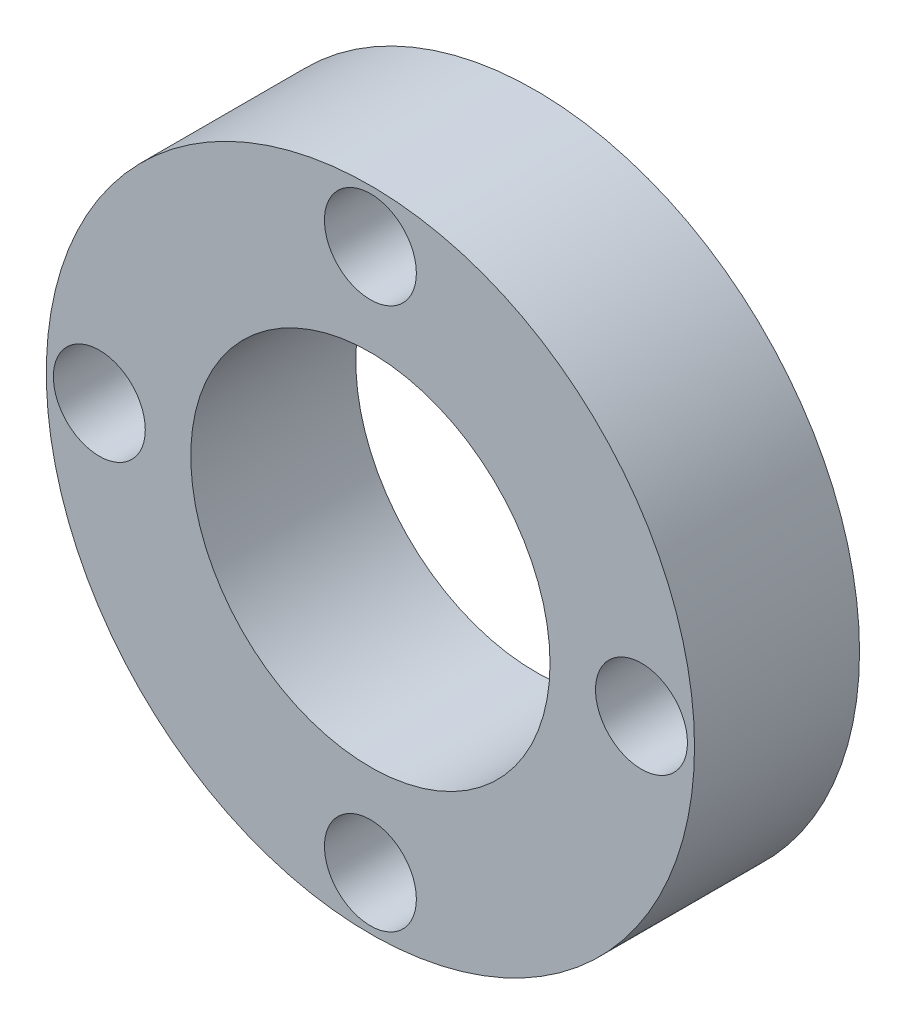
ISO-10303-21;
HEADER;
FILE_DESCRIPTION(('STEP AP214'),'2;1');
FILE_NAME('part.step','',(''),(''),'','','');
FILE_SCHEMA(('AUTOMOTIVE_DESIGN { 1 0 10303 214 1 1 1 1 }'));
ENDSEC;
DATA;
#1=APPLICATION_CONTEXT('core data for automotive mechanical design processes');
#2=APPLICATION_PROTOCOL_DEFINITION('international standard','automotive_design',2000,#1);
#3=PRODUCT_CONTEXT('',#1,'mechanical');
#4=PRODUCT('Part','Part','',(#3));
#5=PRODUCT_RELATED_PRODUCT_CATEGORY('part','',(#4));
#6=PRODUCT_DEFINITION_FORMATION('','',#4);
#7=PRODUCT_DEFINITION_CONTEXT('part definition',#1,'design');
#8=PRODUCT_DEFINITION('design','',#6,#7);
#9=PRODUCT_DEFINITION_SHAPE('','',#8);
#10=(LENGTH_UNIT() NAMED_UNIT(*) SI_UNIT(.MILLI.,.METRE.));
#11=(NAMED_UNIT(*) PLANE_ANGLE_UNIT() SI_UNIT($,.RADIAN.));
#12=(NAMED_UNIT(*) SI_UNIT($,.STERADIAN.) SOLID_ANGLE_UNIT());
#13=UNCERTAINTY_MEASURE_WITH_UNIT(LENGTH_MEASURE(1.E-05),#10,'distance_accuracy_value','');
#14=(GEOMETRIC_REPRESENTATION_CONTEXT(3) GLOBAL_UNCERTAINTY_ASSIGNED_CONTEXT((#13)) GLOBAL_UNIT_ASSIGNED_CONTEXT((#10,
#11,#12)) REPRESENTATION_CONTEXT('',''));
#15=CARTESIAN_POINT('',(0.,0.,0.));
#16=DIRECTION('',(0.,0.,1.));
#17=DIRECTION('',(1.,0.,0.));
#18=AXIS2_PLACEMENT_3D('',#15,#16,#17);
#19=CARTESIAN_POINT('',(0.,0.,-7.));
#20=DIRECTION('',(0.,0.,1.));
#21=DIRECTION('',(1.,0.,0.));
#22=AXIS2_PLACEMENT_3D('',#19,#20,#21);
#23=CYLINDRICAL_SURFACE('',#22,13.75);
#24=CARTESIAN_POINT('',(0.,0.,-7.));
#25=DIRECTION('',(0.,0.,1.));
#26=DIRECTION('',(1.,0.,0.));
#27=AXIS2_PLACEMENT_3D('',#24,#25,#26);
#28=CIRCLE('',#27,13.75);
#29=CARTESIAN_POINT('',(13.75,0.,-7.));
#30=VERTEX_POINT('',#29);
#31=EDGE_CURVE('E10',#30,#30,#28,.T.);
#32=ORIENTED_EDGE('',*,*,#31,.T.);
#33=EDGE_LOOP('',(#32));
#34=FACE_BOUND('',#33,.T.);
#35=CARTESIAN_POINT('',(0.,0.,0.));
#36=DIRECTION('',(0.,0.,1.));
#37=DIRECTION('',(1.,0.,0.));
#38=AXIS2_PLACEMENT_3D('',#35,#36,#37);
#39=CIRCLE('',#38,13.75);
#40=CARTESIAN_POINT('',(13.75,0.,0.));
#41=VERTEX_POINT('',#40);
#42=EDGE_CURVE('E34',#41,#41,#39,.T.);
#43=ORIENTED_EDGE('',*,*,#42,.F.);
#44=EDGE_LOOP('',(#43));
#45=FACE_BOUND('',#44,.T.);
#46=ADVANCED_FACE('F31',(#34,#45),#23,.T.);
#47=CARTESIAN_POINT('',(0.,0.,-7.));
#48=DIRECTION('',(0.,0.,1.));
#49=DIRECTION('',(1.,0.,0.));
#50=AXIS2_PLACEMENT_3D('',#47,#48,#49);
#51=PLANE('',#50);
#52=CARTESIAN_POINT('',(-11.49999986,0.,-7.));
#53=DIRECTION('',(0.,0.,1.));
#54=DIRECTION('',(1.,0.,0.));
#55=AXIS2_PLACEMENT_3D('',#52,#53,#54);
#56=CIRCLE('',#55,1.9499961);
#57=CARTESIAN_POINT('',(-9.55000376,0.,-7.));
#58=VERTEX_POINT('',#57);
#59=EDGE_CURVE('E46',#58,#58,#56,.F.);
#60=ORIENTED_EDGE('',*,*,#59,.F.);
#61=EDGE_LOOP('',(#60));
#62=FACE_BOUND('',#61,.T.);
#63=CARTESIAN_POINT('',(0.,11.49999986,-7.));
#64=DIRECTION('',(0.,0.,1.));
#65=DIRECTION('',(1.,0.,0.));
#66=AXIS2_PLACEMENT_3D('',#63,#64,#65);
#67=CIRCLE('',#66,1.9499961);
#68=CARTESIAN_POINT('',(1.9499961,11.49999986,-7.));
#69=VERTEX_POINT('',#68);
#70=EDGE_CURVE('E62',#69,#69,#67,.F.);
#71=ORIENTED_EDGE('',*,*,#70,.F.);
#72=EDGE_LOOP('',(#71));
#73=FACE_BOUND('',#72,.T.);
#74=CARTESIAN_POINT('',(11.49999986,0.,-7.));
#75=DIRECTION('',(0.,0.,1.));
#76=DIRECTION('',(1.,0.,0.));
#77=AXIS2_PLACEMENT_3D('',#74,#75,#76);
#78=CIRCLE('',#77,1.9499961);
#79=CARTESIAN_POINT('',(13.44999596,0.,-7.));
#80=VERTEX_POINT('',#79);
#81=EDGE_CURVE('E56',#80,#80,#78,.F.);
#82=ORIENTED_EDGE('',*,*,#81,.F.);
#83=EDGE_LOOP('',(#82));
#84=FACE_BOUND('',#83,.T.);
#85=CARTESIAN_POINT('',(0.,-11.49999986,-7.));
#86=DIRECTION('',(0.,0.,1.));
#87=DIRECTION('',(1.,0.,0.));
#88=AXIS2_PLACEMENT_3D('',#85,#86,#87);
#89=CIRCLE('',#88,1.9499961);
#90=CARTESIAN_POINT('',(1.9499961,-11.49999986,-7.));
#91=VERTEX_POINT('',#90);
#92=EDGE_CURVE('E49',#91,#91,#89,.F.);
#93=ORIENTED_EDGE('',*,*,#92,.F.);
#94=EDGE_LOOP('',(#93));
#95=FACE_BOUND('',#94,.T.);
#96=CARTESIAN_POINT('',(0.,0.,-7.));
#97=DIRECTION('',(0.,0.,1.));
#98=DIRECTION('',(1.,0.,0.));
#99=AXIS2_PLACEMENT_3D('',#96,#97,#98);
#100=CIRCLE('',#99,7.62);
#101=CARTESIAN_POINT('',(7.62,0.,-7.));
#102=VERTEX_POINT('',#101);
#103=EDGE_CURVE('E41',#102,#102,#100,.T.);
#104=ORIENTED_EDGE('',*,*,#103,.T.);
#105=EDGE_LOOP('',(#104));
#106=FACE_BOUND('',#105,.T.);
#107=ORIENTED_EDGE('',*,*,#31,.F.);
#108=EDGE_LOOP('',(#107));
#109=FACE_BOUND('',#108,.T.);
#110=ADVANCED_FACE('F80',(#62,#73,#84,#95,#106,#109),#51,.F.);
#111=CARTESIAN_POINT('',(0.,0.,0.));
#112=DIRECTION('',(0.,0.,1.));
#113=DIRECTION('',(1.,0.,0.));
#114=AXIS2_PLACEMENT_3D('',#111,#112,#113);
#115=PLANE('',#114);
#116=CARTESIAN_POINT('',(-11.49999986,0.,0.));
#117=DIRECTION('',(0.,0.,1.));
#118=DIRECTION('',(1.,0.,0.));
#119=AXIS2_PLACEMENT_3D('',#116,#117,#118);
#120=CIRCLE('',#119,1.9499961);
#121=CARTESIAN_POINT('',(-9.55000376,0.,0.));
#122=VERTEX_POINT('',#121);
#123=EDGE_CURVE('E65',#122,#122,#120,.T.);
#124=ORIENTED_EDGE('',*,*,#123,.F.);
#125=EDGE_LOOP('',(#124));
#126=FACE_BOUND('',#125,.T.);
#127=CARTESIAN_POINT('',(0.,11.49999986,0.));
#128=DIRECTION('',(0.,0.,1.));
#129=DIRECTION('',(1.,0.,0.));
#130=AXIS2_PLACEMENT_3D('',#127,#128,#129);
#131=CIRCLE('',#130,1.9499961);
#132=CARTESIAN_POINT('',(1.9499961,11.49999986,0.));
#133=VERTEX_POINT('',#132);
#134=EDGE_CURVE('E59',#133,#133,#131,.T.);
#135=ORIENTED_EDGE('',*,*,#134,.F.);
#136=EDGE_LOOP('',(#135));
#137=FACE_BOUND('',#136,.T.);
#138=CARTESIAN_POINT('',(11.49999986,0.,0.));
#139=DIRECTION('',(0.,0.,1.));
#140=DIRECTION('',(1.,0.,0.));
#141=AXIS2_PLACEMENT_3D('',#138,#139,#140);
#142=CIRCLE('',#141,1.9499961);
#143=CARTESIAN_POINT('',(13.44999596,0.,0.));
#144=VERTEX_POINT('',#143);
#145=EDGE_CURVE('E52',#144,#144,#142,.T.);
#146=ORIENTED_EDGE('',*,*,#145,.F.);
#147=EDGE_LOOP('',(#146));
#148=FACE_BOUND('',#147,.T.);
#149=CARTESIAN_POINT('',(0.,-11.49999986,0.));
#150=DIRECTION('',(0.,0.,1.));
#151=DIRECTION('',(1.,0.,0.));
#152=AXIS2_PLACEMENT_3D('',#149,#150,#151);
#153=CIRCLE('',#152,1.9499961);
#154=CARTESIAN_POINT('',(1.9499961,-11.49999986,0.));
#155=VERTEX_POINT('',#154);
#156=EDGE_CURVE('E53',#155,#155,#153,.T.);
#157=ORIENTED_EDGE('',*,*,#156,.F.);
#158=EDGE_LOOP('',(#157));
#159=FACE_BOUND('',#158,.T.);
#160=CARTESIAN_POINT('',(0.,0.,0.));
#161=DIRECTION('',(0.,0.,1.));
#162=DIRECTION('',(1.,0.,0.));
#163=AXIS2_PLACEMENT_3D('',#160,#161,#162);
#164=CIRCLE('',#163,7.62);
#165=CARTESIAN_POINT('',(7.62,0.,0.));
#166=VERTEX_POINT('',#165);
#167=EDGE_CURVE('E43',#166,#166,#164,.T.);
#168=ORIENTED_EDGE('',*,*,#167,.F.);
#169=EDGE_LOOP('',(#168));
#170=FACE_BOUND('',#169,.T.);
#171=ORIENTED_EDGE('',*,*,#42,.T.);
#172=EDGE_LOOP('',(#171));
#173=FACE_BOUND('',#172,.T.);
#174=ADVANCED_FACE('F76',(#126,#137,#148,#159,#170,#173),#115,.T.);
#175=CARTESIAN_POINT('',(0.,0.,-7.));
#176=DIRECTION('',(0.,0.,1.));
#177=DIRECTION('',(1.,0.,0.));
#178=AXIS2_PLACEMENT_3D('',#175,#176,#177);
#179=CYLINDRICAL_SURFACE('',#178,7.62);
#180=ORIENTED_EDGE('',*,*,#103,.F.);
#181=EDGE_LOOP('',(#180));
#182=FACE_BOUND('',#181,.T.);
#183=ORIENTED_EDGE('',*,*,#167,.T.);
#184=EDGE_LOOP('',(#183));
#185=FACE_BOUND('',#184,.T.);
#186=ADVANCED_FACE('F79',(#182,#185),#179,.F.);
#187=CARTESIAN_POINT('',(0.,-11.49999986,-7.001));
#188=DIRECTION('',(0.,0.,1.));
#189=DIRECTION('',(1.,0.,0.));
#190=AXIS2_PLACEMENT_3D('',#187,#188,#189);
#191=CYLINDRICAL_SURFACE('',#190,1.9499961);
#192=ORIENTED_EDGE('',*,*,#156,.T.);
#193=EDGE_LOOP('',(#192));
#194=FACE_BOUND('',#193,.T.);
#195=ORIENTED_EDGE('',*,*,#92,.T.);
#196=EDGE_LOOP('',(#195));
#197=FACE_BOUND('',#196,.T.);
#198=ADVANCED_FACE('F104',(#194,#197),#191,.F.);
#199=CARTESIAN_POINT('',(11.49999986,0.,-7.001));
#200=DIRECTION('',(0.,0.,1.));
#201=DIRECTION('',(1.,0.,0.));
#202=AXIS2_PLACEMENT_3D('',#199,#200,#201);
#203=CYLINDRICAL_SURFACE('',#202,1.9499961);
#204=ORIENTED_EDGE('',*,*,#145,.T.);
#205=EDGE_LOOP('',(#204));
#206=FACE_BOUND('',#205,.T.);
#207=ORIENTED_EDGE('',*,*,#81,.T.);
#208=EDGE_LOOP('',(#207));
#209=FACE_BOUND('',#208,.T.);
#210=ADVANCED_FACE('F108',(#206,#209),#203,.F.);
#211=CARTESIAN_POINT('',(0.,11.49999986,-7.001));
#212=DIRECTION('',(0.,0.,1.));
#213=DIRECTION('',(1.,0.,0.));
#214=AXIS2_PLACEMENT_3D('',#211,#212,#213);
#215=CYLINDRICAL_SURFACE('',#214,1.9499961);
#216=ORIENTED_EDGE('',*,*,#134,.T.);
#217=EDGE_LOOP('',(#216));
#218=FACE_BOUND('',#217,.T.);
#219=ORIENTED_EDGE('',*,*,#70,.T.);
#220=EDGE_LOOP('',(#219));
#221=FACE_BOUND('',#220,.T.);
#222=ADVANCED_FACE('F112',(#218,#221),#215,.F.);
#223=CARTESIAN_POINT('',(-11.49999986,0.,-7.001));
#224=DIRECTION('',(0.,0.,1.));
#225=DIRECTION('',(1.,0.,0.));
#226=AXIS2_PLACEMENT_3D('',#223,#224,#225);
#227=CYLINDRICAL_SURFACE('',#226,1.9499961);
#228=ORIENTED_EDGE('',*,*,#123,.T.);
#229=EDGE_LOOP('',(#228));
#230=FACE_BOUND('',#229,.T.);
#231=ORIENTED_EDGE('',*,*,#59,.T.);
#232=EDGE_LOOP('',(#231));
#233=FACE_BOUND('',#232,.T.);
#234=ADVANCED_FACE('F73',(#230,#233),#227,.F.);
#235=CLOSED_SHELL('',(#46,#110,#174,#186,#198,#210,#222,#234));
#236=MANIFOLD_SOLID_BREP('B2',#235);
#237=ADVANCED_BREP_SHAPE_REPRESENTATION('',(#18,#236),#14);
#238=SHAPE_DEFINITION_REPRESENTATION(#9,#237);
ENDSEC;
END-ISO-10303-21;
